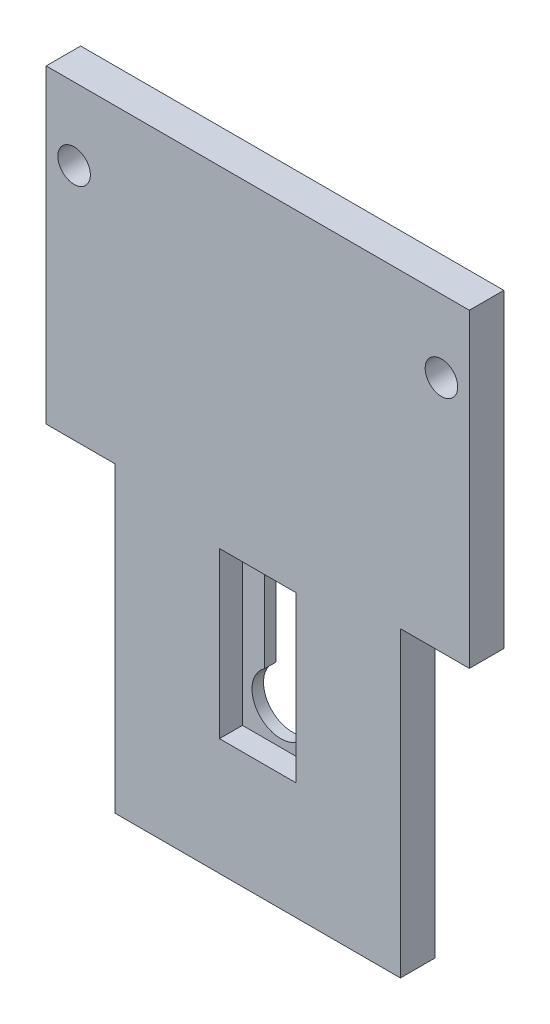
ISO-10303-21;
HEADER;
FILE_DESCRIPTION(('STEP AP214'),'2;1');
FILE_NAME('part.step','',(''),(''),'','','');
FILE_SCHEMA(('AUTOMOTIVE_DESIGN { 1 0 10303 214 1 1 1 1 }'));
ENDSEC;
DATA;
#1=APPLICATION_CONTEXT('core data for automotive mechanical design processes');
#2=APPLICATION_PROTOCOL_DEFINITION('international standard','automotive_design',2000,#1);
#3=PRODUCT_CONTEXT('',#1,'mechanical');
#4=PRODUCT('Part','Part','',(#3));
#5=PRODUCT_RELATED_PRODUCT_CATEGORY('part','',(#4));
#6=PRODUCT_DEFINITION_FORMATION('','',#4);
#7=PRODUCT_DEFINITION_CONTEXT('part definition',#1,'design');
#8=PRODUCT_DEFINITION('design','',#6,#7);
#9=PRODUCT_DEFINITION_SHAPE('','',#8);
#10=(LENGTH_UNIT() NAMED_UNIT(*) SI_UNIT(.MILLI.,.METRE.));
#11=(NAMED_UNIT(*) PLANE_ANGLE_UNIT() SI_UNIT($,.RADIAN.));
#12=(NAMED_UNIT(*) SI_UNIT($,.STERADIAN.) SOLID_ANGLE_UNIT());
#13=UNCERTAINTY_MEASURE_WITH_UNIT(LENGTH_MEASURE(1.E-05),#10,'distance_accuracy_value','');
#14=(GEOMETRIC_REPRESENTATION_CONTEXT(3) GLOBAL_UNCERTAINTY_ASSIGNED_CONTEXT((#13)) GLOBAL_UNIT_ASSIGNED_CONTEXT((#10,
#11,#12)) REPRESENTATION_CONTEXT('',''));
#15=CARTESIAN_POINT('',(0.,0.,0.));
#16=DIRECTION('',(0.,0.,1.));
#17=DIRECTION('',(1.,0.,0.));
#18=AXIS2_PLACEMENT_3D('',#15,#16,#17);
#19=CARTESIAN_POINT('',(10.,73.5,3.));
#20=DIRECTION('',(1.,0.,0.));
#21=DIRECTION('',(0.,1.,0.));
#22=AXIS2_PLACEMENT_3D('',#19,#20,#21);
#23=PLANE('',#22);
#24=DIRECTION('',(0.,0.,1.));
#25=VECTOR('',#24,1.);
#26=CARTESIAN_POINT('',(10.,73.5,3.));
#27=LINE('',#26,#25);
#28=CARTESIAN_POINT('',(10.,73.5,9.));
#29=VERTEX_POINT('',#28);
#30=CARTESIAN_POINT('',(10.,73.5,3.));
#31=VERTEX_POINT('',#30);
#32=EDGE_CURVE('E148',#29,#31,#27,.F.);
#33=ORIENTED_EDGE('',*,*,#32,.T.);
#34=DIRECTION('',(0.,1.,0.));
#35=VECTOR('',#34,1.);
#36=CARTESIAN_POINT('',(10.,0.,3.));
#37=LINE('',#36,#35);
#38=CARTESIAN_POINT('',(10.,30.5,3.));
#39=VERTEX_POINT('',#38);
#40=EDGE_CURVE('E131',#39,#31,#37,.T.);
#41=ORIENTED_EDGE('',*,*,#40,.F.);
#42=DIRECTION('',(0.,0.,-1.));
#43=VECTOR('',#42,1.);
#44=CARTESIAN_POINT('',(10.,30.5,3.));
#45=LINE('',#44,#43);
#46=CARTESIAN_POINT('',(10.,30.5,9.));
#47=VERTEX_POINT('',#46);
#48=EDGE_CURVE('E128',#39,#47,#45,.F.);
#49=ORIENTED_EDGE('',*,*,#48,.T.);
#50=DIRECTION('',(0.,1.,0.));
#51=VECTOR('',#50,1.);
#52=CARTESIAN_POINT('',(10.,0.,9.));
#53=LINE('',#52,#51);
#54=EDGE_CURVE('E116',#29,#47,#53,.F.);
#55=ORIENTED_EDGE('',*,*,#54,.F.);
#56=EDGE_LOOP('',(#33,#41,#49,#55));
#57=FACE_BOUND('',#56,.T.);
#58=ADVANCED_FACE('F16',(#57),#23,.F.);
#59=CARTESIAN_POINT('',(-10.,73.5,3.));
#60=DIRECTION('',(0.,1.,0.));
#61=DIRECTION('',(0.,0.,1.));
#62=AXIS2_PLACEMENT_3D('',#59,#60,#61);
#63=PLANE('',#62);
#64=DIRECTION('',(0.,0.,1.));
#65=VECTOR('',#64,1.);
#66=CARTESIAN_POINT('',(-10.,73.5,3.));
#67=LINE('',#66,#65);
#68=CARTESIAN_POINT('',(-10.,73.5,9.));
#69=VERTEX_POINT('',#68);
#70=CARTESIAN_POINT('',(-10.,73.5,3.));
#71=VERTEX_POINT('',#70);
#72=EDGE_CURVE('E145',#69,#71,#67,.F.);
#73=ORIENTED_EDGE('',*,*,#72,.T.);
#74=DIRECTION('',(1.,0.,0.));
#75=VECTOR('',#74,1.);
#76=CARTESIAN_POINT('',(0.,73.5,3.));
#77=LINE('',#76,#75);
#78=EDGE_CURVE('E179',#31,#71,#77,.F.);
#79=ORIENTED_EDGE('',*,*,#78,.F.);
#80=ORIENTED_EDGE('',*,*,#32,.F.);
#81=DIRECTION('',(1.,0.,0.));
#82=VECTOR('',#81,1.);
#83=CARTESIAN_POINT('',(0.,73.5,9.));
#84=LINE('',#83,#82);
#85=EDGE_CURVE('E125',#69,#29,#84,.T.);
#86=ORIENTED_EDGE('',*,*,#85,.F.);
#87=EDGE_LOOP('',(#73,#79,#80,#86));
#88=FACE_BOUND('',#87,.T.);
#89=ADVANCED_FACE('F475',(#88),#63,.F.);
#90=CARTESIAN_POINT('',(-10.,73.5,3.));
#91=DIRECTION('',(-1.,0.,0.));
#92=DIRECTION('',(0.,-1.,0.));
#93=AXIS2_PLACEMENT_3D('',#90,#91,#92);
#94=PLANE('',#93);
#95=DIRECTION('',(0.,0.,-1.));
#96=VECTOR('',#95,1.);
#97=CARTESIAN_POINT('',(-10.,30.5,3.));
#98=LINE('',#97,#96);
#99=CARTESIAN_POINT('',(-10.,30.5,9.));
#100=VERTEX_POINT('',#99);
#101=CARTESIAN_POINT('',(-10.,30.5,3.));
#102=VERTEX_POINT('',#101);
#103=EDGE_CURVE('E135',#100,#102,#98,.T.);
#104=ORIENTED_EDGE('',*,*,#103,.T.);
#105=DIRECTION('',(0.,1.,0.));
#106=VECTOR('',#105,1.);
#107=CARTESIAN_POINT('',(-10.,0.,3.));
#108=LINE('',#107,#106);
#109=EDGE_CURVE('E176',#71,#102,#108,.F.);
#110=ORIENTED_EDGE('',*,*,#109,.F.);
#111=ORIENTED_EDGE('',*,*,#72,.F.);
#112=DIRECTION('',(0.,1.,0.));
#113=VECTOR('',#112,1.);
#114=CARTESIAN_POINT('',(-10.,0.,9.));
#115=LINE('',#114,#113);
#116=EDGE_CURVE('E139',#100,#69,#115,.T.);
#117=ORIENTED_EDGE('',*,*,#116,.F.);
#118=EDGE_LOOP('',(#104,#110,#111,#117));
#119=FACE_BOUND('',#118,.T.);
#120=ADVANCED_FACE('F331',(#119),#94,.F.);
#121=CARTESIAN_POINT('',(-10.,30.5,3.));
#122=DIRECTION('',(0.,-1.,0.));
#123=DIRECTION('',(0.,0.,-1.));
#124=AXIS2_PLACEMENT_3D('',#121,#122,#123);
#125=PLANE('',#124);
#126=ORIENTED_EDGE('',*,*,#48,.F.);
#127=DIRECTION('',(1.,0.,0.));
#128=VECTOR('',#127,1.);
#129=CARTESIAN_POINT('',(0.,30.5,3.));
#130=LINE('',#129,#128);
#131=EDGE_CURVE('E173',#102,#39,#130,.T.);
#132=ORIENTED_EDGE('',*,*,#131,.F.);
#133=ORIENTED_EDGE('',*,*,#103,.F.);
#134=DIRECTION('',(1.,0.,0.));
#135=VECTOR('',#134,1.);
#136=CARTESIAN_POINT('',(0.,30.5,9.));
#137=LINE('',#136,#135);
#138=EDGE_CURVE('E122',#47,#100,#137,.F.);
#139=ORIENTED_EDGE('',*,*,#138,.F.);
#140=EDGE_LOOP('',(#126,#132,#133,#139));
#141=FACE_BOUND('',#140,.T.);
#142=ADVANCED_FACE('F137',(#141),#125,.F.);
#143=CARTESIAN_POINT('',(0.,0.,9.));
#144=DIRECTION('',(0.,0.,1.));
#145=DIRECTION('',(1.,0.,0.));
#146=AXIS2_PLACEMENT_3D('',#143,#144,#145);
#147=PLANE('',#146);
#148=DIRECTION('',(0.,1.,0.));
#149=VECTOR('',#148,1.);
#150=CARTESIAN_POINT('',(-55.25,160.,9.));
#151=LINE('',#150,#149);
#152=CARTESIAN_POINT('',(-55.25,160.,9.));
#153=VERTEX_POINT('',#152);
#154=CARTESIAN_POINT('',(-55.25,79.,9.));
#155=VERTEX_POINT('',#154);
#156=EDGE_CURVE('E211',#153,#155,#151,.F.);
#157=ORIENTED_EDGE('',*,*,#156,.T.);
#158=DIRECTION('',(-1.,0.,0.));
#159=VECTOR('',#158,1.);
#160=CARTESIAN_POINT('',(-55.25,79.,9.));
#161=LINE('',#160,#159);
#162=CARTESIAN_POINT('',(-37.25,79.,9.));
#163=VERTEX_POINT('',#162);
#164=EDGE_CURVE('E206',#155,#163,#161,.F.);
#165=ORIENTED_EDGE('',*,*,#164,.T.);
#166=DIRECTION('',(0.,1.,0.));
#167=VECTOR('',#166,1.);
#168=CARTESIAN_POINT('',(-37.25,79.,9.));
#169=LINE('',#168,#167);
#170=CARTESIAN_POINT('',(-37.25,0.,9.));
#171=VERTEX_POINT('',#170);
#172=EDGE_CURVE('E200',#163,#171,#169,.F.);
#173=ORIENTED_EDGE('',*,*,#172,.T.);
#174=DIRECTION('',(1.,0.,0.));
#175=VECTOR('',#174,1.);
#176=CARTESIAN_POINT('',(-37.25,0.,9.));
#177=LINE('',#176,#175);
#178=CARTESIAN_POINT('',(37.25,0.,9.));
#179=VERTEX_POINT('',#178);
#180=EDGE_CURVE('E65',#171,#179,#177,.T.);
#181=ORIENTED_EDGE('',*,*,#180,.T.);
#182=DIRECTION('',(0.,-1.,0.));
#183=VECTOR('',#182,1.);
#184=CARTESIAN_POINT('',(37.25,0.,9.));
#185=LINE('',#184,#183);
#186=CARTESIAN_POINT('',(37.25,79.,9.));
#187=VERTEX_POINT('',#186);
#188=EDGE_CURVE('E231',#179,#187,#185,.F.);
#189=ORIENTED_EDGE('',*,*,#188,.T.);
#190=DIRECTION('',(1.,0.,0.));
#191=VECTOR('',#190,1.);
#192=CARTESIAN_POINT('',(37.25,79.,9.));
#193=LINE('',#192,#191);
#194=CARTESIAN_POINT('',(55.25,79.,9.));
#195=VERTEX_POINT('',#194);
#196=EDGE_CURVE('E226',#187,#195,#193,.T.);
#197=ORIENTED_EDGE('',*,*,#196,.T.);
#198=DIRECTION('',(0.,1.,0.));
#199=VECTOR('',#198,1.);
#200=CARTESIAN_POINT('',(55.25,79.,9.));
#201=LINE('',#200,#199);
#202=CARTESIAN_POINT('',(55.25,160.,9.));
#203=VERTEX_POINT('',#202);
#204=EDGE_CURVE('E221',#195,#203,#201,.T.);
#205=ORIENTED_EDGE('',*,*,#204,.T.);
#206=DIRECTION('',(1.,0.,0.));
#207=VECTOR('',#206,1.);
#208=CARTESIAN_POINT('',(55.25,160.,9.));
#209=LINE('',#208,#207);
#210=EDGE_CURVE('E216',#203,#153,#209,.F.);
#211=ORIENTED_EDGE('',*,*,#210,.T.);
#212=EDGE_LOOP('',(#157,#165,#173,#181,#189,#197,#205,#211));
#213=FACE_BOUND('',#212,.T.);
#214=ORIENTED_EDGE('',*,*,#116,.T.);
#215=ORIENTED_EDGE('',*,*,#85,.T.);
#216=ORIENTED_EDGE('',*,*,#54,.T.);
#217=ORIENTED_EDGE('',*,*,#138,.T.);
#218=EDGE_LOOP('',(#214,#215,#216,#217));
#219=FACE_BOUND('',#218,.T.);
#220=CARTESIAN_POINT('',(-47.96,141.1,9.));
#221=DIRECTION('',(0.,0.,-1.));
#222=DIRECTION('',(-1.,0.,0.));
#223=AXIS2_PLACEMENT_3D('',#220,#221,#222);
#224=CIRCLE('',#223,4.25);
#225=CARTESIAN_POINT('',(-52.21,141.1,9.));
#226=VERTEX_POINT('',#225);
#227=EDGE_CURVE('E167',#226,#226,#224,.T.);
#228=ORIENTED_EDGE('',*,*,#227,.T.);
#229=EDGE_LOOP('',(#228));
#230=FACE_BOUND('',#229,.T.);
#231=CARTESIAN_POINT('',(47.96,141.1,9.));
#232=DIRECTION('',(0.,0.,-1.));
#233=DIRECTION('',(-1.,0.,0.));
#234=AXIS2_PLACEMENT_3D('',#231,#232,#233);
#235=CIRCLE('',#234,4.25);
#236=CARTESIAN_POINT('',(43.71,141.1,9.));
#237=VERTEX_POINT('',#236);
#238=EDGE_CURVE('E19',#237,#237,#235,.T.);
#239=ORIENTED_EDGE('',*,*,#238,.T.);
#240=EDGE_LOOP('',(#239));
#241=FACE_BOUND('',#240,.T.);
#242=ADVANCED_FACE('F119',(#213,#219,#230,#241),#147,.T.);
#243=CARTESIAN_POINT('',(0.,0.,3.));
#244=DIRECTION('',(0.,0.,1.));
#245=DIRECTION('',(1.,0.,0.));
#246=AXIS2_PLACEMENT_3D('',#243,#244,#245);
#247=PLANE('',#246);
#248=ORIENTED_EDGE('',*,*,#109,.T.);
#249=ORIENTED_EDGE('',*,*,#131,.T.);
#250=ORIENTED_EDGE('',*,*,#40,.T.);
#251=ORIENTED_EDGE('',*,*,#78,.T.);
#252=EDGE_LOOP('',(#248,#249,#250,#251));
#253=FACE_BOUND('',#252,.T.);
#254=DIRECTION('',(0.,1.,0.));
#255=VECTOR('',#254,1.);
#256=CARTESIAN_POINT('',(4.25,46.1796035471542,3.));
#257=LINE('',#256,#255);
#258=CARTESIAN_POINT('',(4.25,46.1796035471541,3.));
#259=VERTEX_POINT('',#258);
#260=CARTESIAN_POINT('',(4.25,67.,3.));
#261=VERTEX_POINT('',#260);
#262=EDGE_CURVE('E165',#259,#261,#257,.T.);
#263=ORIENTED_EDGE('',*,*,#262,.F.);
#264=CARTESIAN_POINT('',(0.,40.,3.));
#265=DIRECTION('',(0.,0.,-1.));
#266=DIRECTION('',(-1.,0.,0.));
#267=AXIS2_PLACEMENT_3D('',#264,#265,#266);
#268=CIRCLE('',#267,7.5);
#269=CARTESIAN_POINT('',(-4.25,46.1796035471541,3.));
#270=VERTEX_POINT('',#269);
#271=EDGE_CURVE('E161',#259,#270,#268,.T.);
#272=ORIENTED_EDGE('',*,*,#271,.T.);
#273=DIRECTION('',(0.,1.,0.));
#274=VECTOR('',#273,1.);
#275=CARTESIAN_POINT('',(-4.25,46.1796035471542,3.));
#276=LINE('',#275,#274);
#277=CARTESIAN_POINT('',(-4.25,67.,3.));
#278=VERTEX_POINT('',#277);
#279=EDGE_CURVE('E55',#278,#270,#276,.F.);
#280=ORIENTED_EDGE('',*,*,#279,.F.);
#281=CARTESIAN_POINT('',(0.,67.,3.));
#282=DIRECTION('',(0.,0.,-1.));
#283=DIRECTION('',(-1.,0.,0.));
#284=AXIS2_PLACEMENT_3D('',#281,#282,#283);
#285=CIRCLE('',#284,4.25);
#286=EDGE_CURVE('E164',#278,#261,#285,.T.);
#287=ORIENTED_EDGE('',*,*,#286,.T.);
#288=EDGE_LOOP('',(#263,#272,#280,#287));
#289=FACE_BOUND('',#288,.T.);
#290=ADVANCED_FACE('F265',(#253,#289),#247,.T.);
#291=CARTESIAN_POINT('',(47.96,141.1,9.));
#292=DIRECTION('',(0.,0.,-1.));
#293=DIRECTION('',(-1.,0.,0.));
#294=AXIS2_PLACEMENT_3D('',#291,#292,#293);
#295=CYLINDRICAL_SURFACE('',#294,4.25);
#296=CARTESIAN_POINT('',(47.96,141.1,0.));
#297=DIRECTION('',(0.,0.,-1.));
#298=DIRECTION('',(-1.,0.,0.));
#299=AXIS2_PLACEMENT_3D('',#296,#297,#298);
#300=CIRCLE('',#299,4.25);
#301=CARTESIAN_POINT('',(43.71,141.1,0.));
#302=VERTEX_POINT('',#301);
#303=EDGE_CURVE('E158',#302,#302,#300,.T.);
#304=ORIENTED_EDGE('',*,*,#303,.T.);
#305=EDGE_LOOP('',(#304));
#306=FACE_BOUND('',#305,.T.);
#307=ORIENTED_EDGE('',*,*,#238,.F.);
#308=EDGE_LOOP('',(#307));
#309=FACE_BOUND('',#308,.T.);
#310=ADVANCED_FACE('F329',(#306,#309),#295,.F.);
#311=CARTESIAN_POINT('',(-47.96,141.1,9.));
#312=DIRECTION('',(0.,0.,-1.));
#313=DIRECTION('',(-1.,0.,0.));
#314=AXIS2_PLACEMENT_3D('',#311,#312,#313);
#315=CYLINDRICAL_SURFACE('',#314,4.25);
#316=CARTESIAN_POINT('',(-47.96,141.1,0.));
#317=DIRECTION('',(0.,0.,-1.));
#318=DIRECTION('',(-1.,0.,0.));
#319=AXIS2_PLACEMENT_3D('',#316,#317,#318);
#320=CIRCLE('',#319,4.25);
#321=CARTESIAN_POINT('',(-52.21,141.1,0.));
#322=VERTEX_POINT('',#321);
#323=EDGE_CURVE('E154',#322,#322,#320,.T.);
#324=ORIENTED_EDGE('',*,*,#323,.T.);
#325=EDGE_LOOP('',(#324));
#326=FACE_BOUND('',#325,.T.);
#327=ORIENTED_EDGE('',*,*,#227,.F.);
#328=EDGE_LOOP('',(#327));
#329=FACE_BOUND('',#328,.T.);
#330=ADVANCED_FACE('F365',(#326,#329),#315,.F.);
#331=CARTESIAN_POINT('',(-37.25,0.,9.));
#332=DIRECTION('',(0.,1.,0.));
#333=DIRECTION('',(0.,0.,1.));
#334=AXIS2_PLACEMENT_3D('',#331,#332,#333);
#335=PLANE('',#334);
#336=DIRECTION('',(0.,0.,1.));
#337=VECTOR('',#336,1.);
#338=CARTESIAN_POINT('',(37.25,0.,9.));
#339=LINE('',#338,#337);
#340=CARTESIAN_POINT('',(37.25,0.,0.));
#341=VERTEX_POINT('',#340);
#342=EDGE_CURVE('E170',#341,#179,#339,.T.);
#343=ORIENTED_EDGE('',*,*,#342,.T.);
#344=ORIENTED_EDGE('',*,*,#180,.F.);
#345=DIRECTION('',(0.,0.,1.));
#346=VECTOR('',#345,1.);
#347=CARTESIAN_POINT('',(-37.25,0.,9.));
#348=LINE('',#347,#346);
#349=CARTESIAN_POINT('',(-37.25,0.,0.));
#350=VERTEX_POINT('',#349);
#351=EDGE_CURVE('E186',#171,#350,#348,.F.);
#352=ORIENTED_EDGE('',*,*,#351,.T.);
#353=DIRECTION('',(1.,0.,0.));
#354=VECTOR('',#353,1.);
#355=CARTESIAN_POINT('',(0.,0.,0.));
#356=LINE('',#355,#354);
#357=EDGE_CURVE('E157',#350,#341,#356,.T.);
#358=ORIENTED_EDGE('',*,*,#357,.T.);
#359=EDGE_LOOP('',(#343,#344,#352,#358));
#360=FACE_BOUND('',#359,.T.);
#361=ADVANCED_FACE('F234',(#360),#335,.F.);
#362=CARTESIAN_POINT('',(37.25,0.,9.));
#363=DIRECTION('',(-1.,0.,0.));
#364=DIRECTION('',(0.,-1.,0.));
#365=AXIS2_PLACEMENT_3D('',#362,#363,#364);
#366=PLANE('',#365);
#367=DIRECTION('',(0.,0.,1.));
#368=VECTOR('',#367,1.);
#369=CARTESIAN_POINT('',(37.25,79.,9.));
#370=LINE('',#369,#368);
#371=CARTESIAN_POINT('',(37.25,79.,0.));
#372=VERTEX_POINT('',#371);
#373=EDGE_CURVE('E228',#372,#187,#370,.T.);
#374=ORIENTED_EDGE('',*,*,#373,.T.);
#375=ORIENTED_EDGE('',*,*,#188,.F.);
#376=ORIENTED_EDGE('',*,*,#342,.F.);
#377=DIRECTION('',(0.,1.,0.));
#378=VECTOR('',#377,1.);
#379=CARTESIAN_POINT('',(37.25,0.,0.));
#380=LINE('',#379,#378);
#381=EDGE_CURVE('E242',#341,#372,#380,.T.);
#382=ORIENTED_EDGE('',*,*,#381,.T.);
#383=EDGE_LOOP('',(#374,#375,#376,#382));
#384=FACE_BOUND('',#383,.T.);
#385=ADVANCED_FACE('F240',(#384),#366,.F.);
#386=CARTESIAN_POINT('',(37.25,79.,9.));
#387=DIRECTION('',(0.,1.,0.));
#388=DIRECTION('',(0.,0.,1.));
#389=AXIS2_PLACEMENT_3D('',#386,#387,#388);
#390=PLANE('',#389);
#391=DIRECTION('',(0.,0.,1.));
#392=VECTOR('',#391,1.);
#393=CARTESIAN_POINT('',(55.25,79.,9.));
#394=LINE('',#393,#392);
#395=CARTESIAN_POINT('',(55.25,79.,0.));
#396=VERTEX_POINT('',#395);
#397=EDGE_CURVE('E223',#396,#195,#394,.T.);
#398=ORIENTED_EDGE('',*,*,#397,.T.);
#399=ORIENTED_EDGE('',*,*,#196,.F.);
#400=ORIENTED_EDGE('',*,*,#373,.F.);
#401=DIRECTION('',(1.,0.,0.));
#402=VECTOR('',#401,1.);
#403=CARTESIAN_POINT('',(0.,79.,0.));
#404=LINE('',#403,#402);
#405=EDGE_CURVE('E251',#372,#396,#404,.T.);
#406=ORIENTED_EDGE('',*,*,#405,.T.);
#407=EDGE_LOOP('',(#398,#399,#400,#406));
#408=FACE_BOUND('',#407,.T.);
#409=ADVANCED_FACE('F298',(#408),#390,.F.);
#410=CARTESIAN_POINT('',(55.25,79.,9.));
#411=DIRECTION('',(-1.,0.,0.));
#412=DIRECTION('',(0.,0.,1.));
#413=AXIS2_PLACEMENT_3D('',#410,#411,#412);
#414=PLANE('',#413);
#415=DIRECTION('',(0.,0.,-1.));
#416=VECTOR('',#415,1.);
#417=CARTESIAN_POINT('',(55.25,160.,9.));
#418=LINE('',#417,#416);
#419=CARTESIAN_POINT('',(55.25,160.,0.));
#420=VERTEX_POINT('',#419);
#421=EDGE_CURVE('E218',#420,#203,#418,.F.);
#422=ORIENTED_EDGE('',*,*,#421,.T.);
#423=ORIENTED_EDGE('',*,*,#204,.F.);
#424=ORIENTED_EDGE('',*,*,#397,.F.);
#425=DIRECTION('',(0.,1.,0.));
#426=VECTOR('',#425,1.);
#427=CARTESIAN_POINT('',(55.25,0.,0.));
#428=LINE('',#427,#426);
#429=EDGE_CURVE('E253',#396,#420,#428,.T.);
#430=ORIENTED_EDGE('',*,*,#429,.T.);
#431=EDGE_LOOP('',(#422,#423,#424,#430));
#432=FACE_BOUND('',#431,.T.);
#433=ADVANCED_FACE('F287',(#432),#414,.F.);
#434=CARTESIAN_POINT('',(55.25,160.,9.));
#435=DIRECTION('',(0.,-1.,0.));
#436=DIRECTION('',(0.,0.,-1.));
#437=AXIS2_PLACEMENT_3D('',#434,#435,#436);
#438=PLANE('',#437);
#439=DIRECTION('',(0.,0.,-1.));
#440=VECTOR('',#439,1.);
#441=CARTESIAN_POINT('',(-55.25,160.,9.));
#442=LINE('',#441,#440);
#443=CARTESIAN_POINT('',(-55.25,160.,0.));
#444=VERTEX_POINT('',#443);
#445=EDGE_CURVE('E213',#444,#153,#442,.F.);
#446=ORIENTED_EDGE('',*,*,#445,.T.);
#447=ORIENTED_EDGE('',*,*,#210,.F.);
#448=ORIENTED_EDGE('',*,*,#421,.F.);
#449=DIRECTION('',(1.,0.,0.));
#450=VECTOR('',#449,1.);
#451=CARTESIAN_POINT('',(0.,160.,0.));
#452=LINE('',#451,#450);
#453=EDGE_CURVE('E281',#420,#444,#452,.F.);
#454=ORIENTED_EDGE('',*,*,#453,.T.);
#455=EDGE_LOOP('',(#446,#447,#448,#454));
#456=FACE_BOUND('',#455,.T.);
#457=ADVANCED_FACE('F318',(#456),#438,.F.);
#458=CARTESIAN_POINT('',(-55.25,160.,9.));
#459=DIRECTION('',(1.,0.,0.));
#460=DIRECTION('',(0.,0.,-1.));
#461=AXIS2_PLACEMENT_3D('',#458,#459,#460);
#462=PLANE('',#461);
#463=DIRECTION('',(0.,0.,1.));
#464=VECTOR('',#463,1.);
#465=CARTESIAN_POINT('',(-55.25,79.,9.));
#466=LINE('',#465,#464);
#467=CARTESIAN_POINT('',(-55.25,79.,0.));
#468=VERTEX_POINT('',#467);
#469=EDGE_CURVE('E208',#468,#155,#466,.T.);
#470=ORIENTED_EDGE('',*,*,#469,.T.);
#471=ORIENTED_EDGE('',*,*,#156,.F.);
#472=ORIENTED_EDGE('',*,*,#445,.F.);
#473=DIRECTION('',(0.,1.,0.));
#474=VECTOR('',#473,1.);
#475=CARTESIAN_POINT('',(-55.25,0.,0.));
#476=LINE('',#475,#474);
#477=EDGE_CURVE('E278',#444,#468,#476,.F.);
#478=ORIENTED_EDGE('',*,*,#477,.T.);
#479=EDGE_LOOP('',(#470,#471,#472,#478));
#480=FACE_BOUND('',#479,.T.);
#481=ADVANCED_FACE('F316',(#480),#462,.F.);
#482=CARTESIAN_POINT('',(-55.25,79.,9.));
#483=DIRECTION('',(0.,1.,0.));
#484=DIRECTION('',(-1.,0.,0.));
#485=AXIS2_PLACEMENT_3D('',#482,#483,#484);
#486=PLANE('',#485);
#487=DIRECTION('',(0.,0.,1.));
#488=VECTOR('',#487,1.);
#489=CARTESIAN_POINT('',(-37.25,79.,9.));
#490=LINE('',#489,#488);
#491=CARTESIAN_POINT('',(-37.25,79.,0.));
#492=VERTEX_POINT('',#491);
#493=EDGE_CURVE('E203',#492,#163,#490,.T.);
#494=ORIENTED_EDGE('',*,*,#493,.T.);
#495=ORIENTED_EDGE('',*,*,#164,.F.);
#496=ORIENTED_EDGE('',*,*,#469,.F.);
#497=DIRECTION('',(1.,0.,0.));
#498=VECTOR('',#497,1.);
#499=CARTESIAN_POINT('',(0.,79.,0.));
#500=LINE('',#499,#498);
#501=EDGE_CURVE('E275',#468,#492,#500,.T.);
#502=ORIENTED_EDGE('',*,*,#501,.T.);
#503=EDGE_LOOP('',(#494,#495,#496,#502));
#504=FACE_BOUND('',#503,.T.);
#505=ADVANCED_FACE('F313',(#504),#486,.F.);
#506=CARTESIAN_POINT('',(-37.25,79.,9.));
#507=DIRECTION('',(1.,0.,0.));
#508=DIRECTION('',(0.,1.,0.));
#509=AXIS2_PLACEMENT_3D('',#506,#507,#508);
#510=PLANE('',#509);
#511=ORIENTED_EDGE('',*,*,#351,.F.);
#512=ORIENTED_EDGE('',*,*,#172,.F.);
#513=ORIENTED_EDGE('',*,*,#493,.F.);
#514=DIRECTION('',(0.,1.,0.));
#515=VECTOR('',#514,1.);
#516=CARTESIAN_POINT('',(-37.25,0.,0.));
#517=LINE('',#516,#515);
#518=EDGE_CURVE('E272',#492,#350,#517,.F.);
#519=ORIENTED_EDGE('',*,*,#518,.T.);
#520=EDGE_LOOP('',(#511,#512,#513,#519));
#521=FACE_BOUND('',#520,.T.);
#522=ADVANCED_FACE('F310',(#521),#510,.F.);
#523=CARTESIAN_POINT('',(-4.25,46.1796035471542,3.));
#524=DIRECTION('',(1.,0.,0.));
#525=DIRECTION('',(0.,0.,-1.));
#526=AXIS2_PLACEMENT_3D('',#523,#524,#525);
#527=PLANE('',#526);
#528=ORIENTED_EDGE('',*,*,#279,.T.);
#529=DIRECTION('',(0.,0.,-1.));
#530=VECTOR('',#529,1.);
#531=CARTESIAN_POINT('',(-4.25,46.1796035471541,3.));
#532=LINE('',#531,#530);
#533=CARTESIAN_POINT('',(-4.25,46.1796035471541,0.));
#534=VERTEX_POINT('',#533);
#535=EDGE_CURVE('E163',#270,#534,#532,.T.);
#536=ORIENTED_EDGE('',*,*,#535,.T.);
#537=DIRECTION('',(0.,1.,0.));
#538=VECTOR('',#537,1.);
#539=CARTESIAN_POINT('',(-4.25,0.,0.));
#540=LINE('',#539,#538);
#541=CARTESIAN_POINT('',(-4.25,67.,0.));
#542=VERTEX_POINT('',#541);
#543=EDGE_CURVE('E153',#534,#542,#540,.T.);
#544=ORIENTED_EDGE('',*,*,#543,.T.);
#545=DIRECTION('',(0.,0.,-1.));
#546=VECTOR('',#545,1.);
#547=CARTESIAN_POINT('',(-4.25,67.,3.));
#548=LINE('',#547,#546);
#549=EDGE_CURVE('E166',#542,#278,#548,.F.);
#550=ORIENTED_EDGE('',*,*,#549,.T.);
#551=EDGE_LOOP('',(#528,#536,#544,#550));
#552=FACE_BOUND('',#551,.T.);
#553=ADVANCED_FACE('F261',(#552),#527,.T.);
#554=CARTESIAN_POINT('',(0.,67.,3.));
#555=DIRECTION('',(0.,0.,-1.));
#556=DIRECTION('',(-1.,0.,0.));
#557=AXIS2_PLACEMENT_3D('',#554,#555,#556);
#558=CYLINDRICAL_SURFACE('',#557,4.25);
#559=DIRECTION('',(0.,0.,1.));
#560=VECTOR('',#559,1.);
#561=CARTESIAN_POINT('',(4.25,67.,3.));
#562=LINE('',#561,#560);
#563=CARTESIAN_POINT('',(4.25,67.,0.));
#564=VERTEX_POINT('',#563);
#565=EDGE_CURVE('E187',#261,#564,#562,.F.);
#566=ORIENTED_EDGE('',*,*,#565,.F.);
#567=ORIENTED_EDGE('',*,*,#286,.F.);
#568=ORIENTED_EDGE('',*,*,#549,.F.);
#569=CARTESIAN_POINT('',(0.,67.,0.));
#570=DIRECTION('',(0.,0.,-1.));
#571=DIRECTION('',(-1.,0.,0.));
#572=AXIS2_PLACEMENT_3D('',#569,#570,#571);
#573=CIRCLE('',#572,4.25);
#574=EDGE_CURVE('E150',#542,#564,#573,.T.);
#575=ORIENTED_EDGE('',*,*,#574,.T.);
#576=EDGE_LOOP('',(#566,#567,#568,#575));
#577=FACE_BOUND('',#576,.T.);
#578=ADVANCED_FACE('F343',(#577),#558,.F.);
#579=CARTESIAN_POINT('',(4.25,46.1796035471542,3.));
#580=DIRECTION('',(-1.,0.,0.));
#581=DIRECTION('',(0.,0.,1.));
#582=AXIS2_PLACEMENT_3D('',#579,#580,#581);
#583=PLANE('',#582);
#584=ORIENTED_EDGE('',*,*,#262,.T.);
#585=ORIENTED_EDGE('',*,*,#565,.T.);
#586=DIRECTION('',(0.,1.,0.));
#587=VECTOR('',#586,1.);
#588=CARTESIAN_POINT('',(4.25,0.,0.));
#589=LINE('',#588,#587);
#590=CARTESIAN_POINT('',(4.25,46.1796035471541,0.));
#591=VERTEX_POINT('',#590);
#592=EDGE_CURVE('E25',#564,#591,#589,.F.);
#593=ORIENTED_EDGE('',*,*,#592,.T.);
#594=DIRECTION('',(0.,0.,-1.));
#595=VECTOR('',#594,1.);
#596=CARTESIAN_POINT('',(4.25,46.1796035471541,3.));
#597=LINE('',#596,#595);
#598=EDGE_CURVE('E33',#591,#259,#597,.F.);
#599=ORIENTED_EDGE('',*,*,#598,.T.);
#600=EDGE_LOOP('',(#584,#585,#593,#599));
#601=FACE_BOUND('',#600,.T.);
#602=ADVANCED_FACE('F266',(#601),#583,.T.);
#603=CARTESIAN_POINT('',(0.,40.,3.));
#604=DIRECTION('',(0.,0.,-1.));
#605=DIRECTION('',(-1.,0.,0.));
#606=AXIS2_PLACEMENT_3D('',#603,#604,#605);
#607=CYLINDRICAL_SURFACE('',#606,7.5);
#608=ORIENTED_EDGE('',*,*,#271,.F.);
#609=ORIENTED_EDGE('',*,*,#598,.F.);
#610=CARTESIAN_POINT('',(0.,40.,0.));
#611=DIRECTION('',(0.,0.,-1.));
#612=DIRECTION('',(-1.,0.,0.));
#613=AXIS2_PLACEMENT_3D('',#610,#611,#612);
#614=CIRCLE('',#613,7.5);
#615=EDGE_CURVE('E11',#591,#534,#614,.T.);
#616=ORIENTED_EDGE('',*,*,#615,.T.);
#617=ORIENTED_EDGE('',*,*,#535,.F.);
#618=EDGE_LOOP('',(#608,#609,#616,#617));
#619=FACE_BOUND('',#618,.T.);
#620=ADVANCED_FACE('F264',(#619),#607,.F.);
#621=CARTESIAN_POINT('',(0.,0.,0.));
#622=DIRECTION('',(0.,0.,1.));
#623=DIRECTION('',(1.,0.,0.));
#624=AXIS2_PLACEMENT_3D('',#621,#622,#623);
#625=PLANE('',#624);
#626=ORIENTED_EDGE('',*,*,#543,.F.);
#627=ORIENTED_EDGE('',*,*,#615,.F.);
#628=ORIENTED_EDGE('',*,*,#592,.F.);
#629=ORIENTED_EDGE('',*,*,#574,.F.);
#630=EDGE_LOOP('',(#626,#627,#628,#629));
#631=FACE_BOUND('',#630,.T.);
#632=ORIENTED_EDGE('',*,*,#501,.F.);
#633=ORIENTED_EDGE('',*,*,#477,.F.);
#634=ORIENTED_EDGE('',*,*,#453,.F.);
#635=ORIENTED_EDGE('',*,*,#429,.F.);
#636=ORIENTED_EDGE('',*,*,#405,.F.);
#637=ORIENTED_EDGE('',*,*,#381,.F.);
#638=ORIENTED_EDGE('',*,*,#357,.F.);
#639=ORIENTED_EDGE('',*,*,#518,.F.);
#640=EDGE_LOOP('',(#632,#633,#634,#635,#636,#637,#638,#639));
#641=FACE_BOUND('',#640,.T.);
#642=ORIENTED_EDGE('',*,*,#323,.F.);
#643=EDGE_LOOP('',(#642));
#644=FACE_BOUND('',#643,.T.);
#645=ORIENTED_EDGE('',*,*,#303,.F.);
#646=EDGE_LOOP('',(#645));
#647=FACE_BOUND('',#646,.T.);
#648=ADVANCED_FACE('F246',(#631,#641,#644,#647),#625,.F.);
#649=CLOSED_SHELL('',(#58,#89,#120,#142,#242,#290,#310,#330,#361,#385,#409,#433,#457,#481,#505,
#522,#553,#578,#602,#620,#648));
#650=MANIFOLD_SOLID_BREP('B1',#649);
#651=ADVANCED_BREP_SHAPE_REPRESENTATION('',(#18,#650),#14);
#652=SHAPE_DEFINITION_REPRESENTATION(#9,#651);
ENDSEC;
END-ISO-10303-21;
